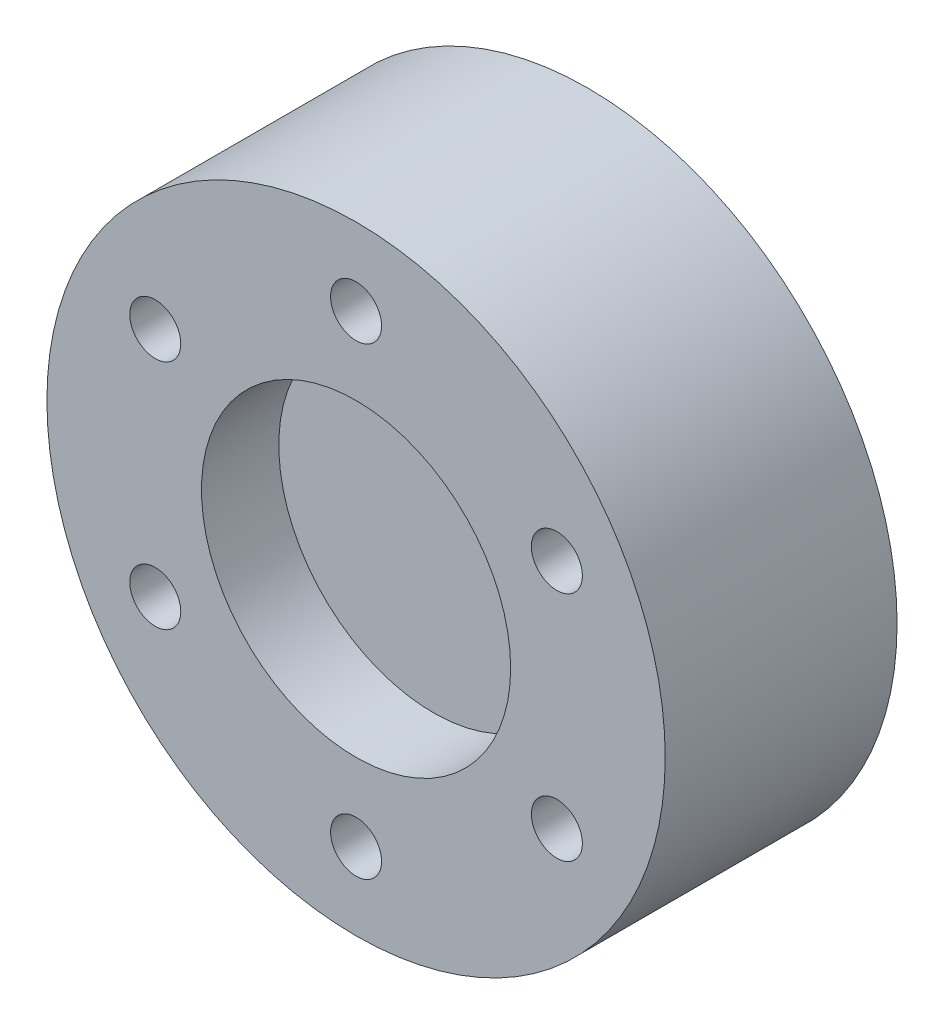
ISO-10303-21;
HEADER;
FILE_DESCRIPTION(('STEP AP214'),'2;1');
FILE_NAME('part.step','',(''),(''),'','','');
FILE_SCHEMA(('AUTOMOTIVE_DESIGN { 1 0 10303 214 1 1 1 1 }'));
ENDSEC;
DATA;
#1=APPLICATION_CONTEXT('core data for automotive mechanical design processes');
#2=APPLICATION_PROTOCOL_DEFINITION('international standard','automotive_design',2000,#1);
#3=PRODUCT_CONTEXT('',#1,'mechanical');
#4=PRODUCT('Part','Part','',(#3));
#5=PRODUCT_RELATED_PRODUCT_CATEGORY('part','',(#4));
#6=PRODUCT_DEFINITION_FORMATION('','',#4);
#7=PRODUCT_DEFINITION_CONTEXT('part definition',#1,'design');
#8=PRODUCT_DEFINITION('design','',#6,#7);
#9=PRODUCT_DEFINITION_SHAPE('','',#8);
#10=(LENGTH_UNIT() NAMED_UNIT(*) SI_UNIT(.MILLI.,.METRE.));
#11=(NAMED_UNIT(*) PLANE_ANGLE_UNIT() SI_UNIT($,.RADIAN.));
#12=(NAMED_UNIT(*) SI_UNIT($,.STERADIAN.) SOLID_ANGLE_UNIT());
#13=UNCERTAINTY_MEASURE_WITH_UNIT(LENGTH_MEASURE(1.E-05),#10,'distance_accuracy_value','');
#14=(GEOMETRIC_REPRESENTATION_CONTEXT(3) GLOBAL_UNCERTAINTY_ASSIGNED_CONTEXT((#13)) GLOBAL_UNIT_ASSIGNED_CONTEXT((#10,
#11,#12)) REPRESENTATION_CONTEXT('',''));
#15=CARTESIAN_POINT('',(0.,0.,0.));
#16=DIRECTION('',(0.,0.,1.));
#17=DIRECTION('',(1.,0.,0.));
#18=AXIS2_PLACEMENT_3D('',#15,#16,#17);
#19=CARTESIAN_POINT('',(0.,0.,15.));
#20=DIRECTION('',(0.,0.,-1.));
#21=DIRECTION('',(-1.,0.,0.));
#22=AXIS2_PLACEMENT_3D('',#19,#20,#21);
#23=CYLINDRICAL_SURFACE('',#22,20.);
#24=CARTESIAN_POINT('',(0.,0.,15.));
#25=DIRECTION('',(0.,0.,1.));
#26=DIRECTION('',(1.,0.,0.));
#27=AXIS2_PLACEMENT_3D('',#24,#25,#26);
#28=CIRCLE('',#27,20.);
#29=CARTESIAN_POINT('',(20.,0.,15.));
#30=VERTEX_POINT('',#29);
#31=EDGE_CURVE('E11',#30,#30,#28,.T.);
#32=ORIENTED_EDGE('',*,*,#31,.F.);
#33=EDGE_LOOP('',(#32));
#34=FACE_BOUND('',#33,.T.);
#35=CARTESIAN_POINT('',(0.,0.,0.));
#36=DIRECTION('',(0.,0.,1.));
#37=DIRECTION('',(1.,0.,0.));
#38=AXIS2_PLACEMENT_3D('',#35,#36,#37);
#39=CIRCLE('',#38,20.);
#40=CARTESIAN_POINT('',(20.,0.,0.));
#41=VERTEX_POINT('',#40);
#42=EDGE_CURVE('E45',#41,#41,#39,.T.);
#43=ORIENTED_EDGE('',*,*,#42,.T.);
#44=EDGE_LOOP('',(#43));
#45=FACE_BOUND('',#44,.T.);
#46=ADVANCED_FACE('F42',(#34,#45),#23,.T.);
#47=CARTESIAN_POINT('',(0.,0.,15.));
#48=DIRECTION('',(0.,0.,1.));
#49=DIRECTION('',(1.,0.,0.));
#50=AXIS2_PLACEMENT_3D('',#47,#48,#49);
#51=PLANE('',#50);
#52=CARTESIAN_POINT('',(12.9903810567665,7.50000000000015,15.));
#53=DIRECTION('',(0.,0.,1.));
#54=DIRECTION('',(1.,0.,0.));
#55=AXIS2_PLACEMENT_3D('',#52,#53,#54);
#56=CIRCLE('',#55,1.65);
#57=CARTESIAN_POINT('',(14.6403810567665,7.50000000000015,15.));
#58=VERTEX_POINT('',#57);
#59=EDGE_CURVE('E79',#58,#58,#56,.T.);
#60=ORIENTED_EDGE('',*,*,#59,.F.);
#61=EDGE_LOOP('',(#60));
#62=FACE_BOUND('',#61,.T.);
#63=CARTESIAN_POINT('',(12.9903810567666,-7.49999999999988,15.));
#64=DIRECTION('',(0.,0.,1.));
#65=DIRECTION('',(1.,0.,0.));
#66=AXIS2_PLACEMENT_3D('',#63,#64,#65);
#67=CIRCLE('',#66,1.65);
#68=CARTESIAN_POINT('',(14.6403810567666,-7.49999999999988,15.));
#69=VERTEX_POINT('',#68);
#70=EDGE_CURVE('E78',#69,#69,#67,.T.);
#71=ORIENTED_EDGE('',*,*,#70,.F.);
#72=EDGE_LOOP('',(#71));
#73=FACE_BOUND('',#72,.T.);
#74=CARTESIAN_POINT('',(0.,-15.,15.));
#75=DIRECTION('',(0.,0.,1.));
#76=DIRECTION('',(1.,0.,0.));
#77=AXIS2_PLACEMENT_3D('',#74,#75,#76);
#78=CIRCLE('',#77,1.65);
#79=CARTESIAN_POINT('',(1.65,-15.,15.));
#80=VERTEX_POINT('',#79);
#81=EDGE_CURVE('E91',#80,#80,#78,.T.);
#82=ORIENTED_EDGE('',*,*,#81,.F.);
#83=EDGE_LOOP('',(#82));
#84=FACE_BOUND('',#83,.T.);
#85=CARTESIAN_POINT('',(-12.9903810567665,-7.50000000000006,15.));
#86=DIRECTION('',(0.,0.,1.));
#87=DIRECTION('',(1.,0.,0.));
#88=AXIS2_PLACEMENT_3D('',#85,#86,#87);
#89=CIRCLE('',#88,1.65);
#90=CARTESIAN_POINT('',(-11.3403810567665,-7.50000000000006,15.));
#91=VERTEX_POINT('',#90);
#92=EDGE_CURVE('E97',#91,#91,#89,.T.);
#93=ORIENTED_EDGE('',*,*,#92,.F.);
#94=EDGE_LOOP('',(#93));
#95=FACE_BOUND('',#94,.T.);
#96=CARTESIAN_POINT('',(-12.9903810567666,7.49999999999997,15.));
#97=DIRECTION('',(0.,0.,1.));
#98=DIRECTION('',(1.,0.,0.));
#99=AXIS2_PLACEMENT_3D('',#96,#97,#98);
#100=CIRCLE('',#99,1.65);
#101=CARTESIAN_POINT('',(-11.3403810567666,7.49999999999997,15.));
#102=VERTEX_POINT('',#101);
#103=EDGE_CURVE('E103',#102,#102,#100,.T.);
#104=ORIENTED_EDGE('',*,*,#103,.F.);
#105=EDGE_LOOP('',(#104));
#106=FACE_BOUND('',#105,.T.);
#107=CARTESIAN_POINT('',(0.,15.,15.));
#108=DIRECTION('',(0.,0.,1.));
#109=DIRECTION('',(1.,0.,0.));
#110=AXIS2_PLACEMENT_3D('',#107,#108,#109);
#111=CIRCLE('',#110,1.65);
#112=CARTESIAN_POINT('',(1.65,15.,15.));
#113=VERTEX_POINT('',#112);
#114=EDGE_CURVE('E109',#113,#113,#111,.T.);
#115=ORIENTED_EDGE('',*,*,#114,.F.);
#116=EDGE_LOOP('',(#115));
#117=FACE_BOUND('',#116,.T.);
#118=CARTESIAN_POINT('',(0.,0.,15.));
#119=DIRECTION('',(0.,0.,1.));
#120=DIRECTION('',(1.,0.,0.));
#121=AXIS2_PLACEMENT_3D('',#118,#119,#120);
#122=CIRCLE('',#121,10.);
#123=CARTESIAN_POINT('',(10.,0.,15.));
#124=VERTEX_POINT('',#123);
#125=EDGE_CURVE('E115',#124,#124,#122,.T.);
#126=ORIENTED_EDGE('',*,*,#125,.F.);
#127=EDGE_LOOP('',(#126));
#128=FACE_BOUND('',#127,.T.);
#129=ORIENTED_EDGE('',*,*,#31,.T.);
#130=EDGE_LOOP('',(#129));
#131=FACE_BOUND('',#130,.T.);
#132=ADVANCED_FACE('F124',(#62,#73,#84,#95,#106,#117,#128,#131),#51,.T.);
#133=CARTESIAN_POINT('',(0.,0.,0.));
#134=DIRECTION('',(0.,0.,1.));
#135=DIRECTION('',(1.,0.,0.));
#136=AXIS2_PLACEMENT_3D('',#133,#134,#135);
#137=PLANE('',#136);
#138=CARTESIAN_POINT('',(0.,0.,0.));
#139=DIRECTION('',(0.,0.,-1.));
#140=DIRECTION('',(-1.,0.,0.));
#141=AXIS2_PLACEMENT_3D('',#138,#139,#140);
#142=CIRCLE('',#141,17.5);
#143=CARTESIAN_POINT('',(-17.5,0.,0.));
#144=VERTEX_POINT('',#143);
#145=EDGE_CURVE('E200',#144,#144,#142,.T.);
#146=ORIENTED_EDGE('',*,*,#145,.F.);
#147=EDGE_LOOP('',(#146));
#148=FACE_BOUND('',#147,.T.);
#149=ORIENTED_EDGE('',*,*,#42,.F.);
#150=EDGE_LOOP('',(#149));
#151=FACE_BOUND('',#150,.T.);
#152=ADVANCED_FACE('F127',(#148,#151),#137,.F.);
#153=CARTESIAN_POINT('',(0.,0.,10.));
#154=DIRECTION('',(0.,0.,1.));
#155=DIRECTION('',(1.,0.,0.));
#156=AXIS2_PLACEMENT_3D('',#153,#154,#155);
#157=CYLINDRICAL_SURFACE('',#156,10.);
#158=CARTESIAN_POINT('',(0.,0.,10.));
#159=DIRECTION('',(0.,0.,1.));
#160=DIRECTION('',(1.,0.,0.));
#161=AXIS2_PLACEMENT_3D('',#158,#159,#160);
#162=CIRCLE('',#161,10.);
#163=CARTESIAN_POINT('',(10.,0.,10.));
#164=VERTEX_POINT('',#163);
#165=EDGE_CURVE('E116',#164,#164,#162,.T.);
#166=ORIENTED_EDGE('',*,*,#165,.F.);
#167=EDGE_LOOP('',(#166));
#168=FACE_BOUND('',#167,.T.);
#169=ORIENTED_EDGE('',*,*,#125,.T.);
#170=EDGE_LOOP('',(#169));
#171=FACE_BOUND('',#170,.T.);
#172=ADVANCED_FACE('F122',(#168,#171),#157,.F.);
#173=CARTESIAN_POINT('',(0.,0.,10.));
#174=DIRECTION('',(0.,0.,1.));
#175=DIRECTION('',(1.,0.,0.));
#176=AXIS2_PLACEMENT_3D('',#173,#174,#175);
#177=PLANE('',#176);
#178=ORIENTED_EDGE('',*,*,#165,.T.);
#179=EDGE_LOOP('',(#178));
#180=FACE_BOUND('',#179,.T.);
#181=ADVANCED_FACE('F142',(#180),#177,.T.);
#182=CARTESIAN_POINT('',(0.,15.,4.9));
#183=DIRECTION('',(0.,0.,1.));
#184=DIRECTION('',(1.,0.,0.));
#185=AXIS2_PLACEMENT_3D('',#182,#183,#184);
#186=CONICAL_SURFACE('',#185,1.65,1.02974425867665);
#187=CARTESIAN_POINT('',(0.,15.,3.90857997860452));
#188=VERTEX_POINT('',#187);
#189=VERTEX_LOOP('',#188);
#190=FACE_BOUND('',#189,.T.);
#191=CARTESIAN_POINT('',(0.,15.,4.9));
#192=DIRECTION('',(0.,0.,1.));
#193=DIRECTION('',(1.,0.,0.));
#194=AXIS2_PLACEMENT_3D('',#191,#192,#193);
#195=CIRCLE('',#194,1.65);
#196=CARTESIAN_POINT('',(1.65,15.,4.9));
#197=VERTEX_POINT('',#196);
#198=EDGE_CURVE('E112',#197,#197,#195,.T.);
#199=ORIENTED_EDGE('',*,*,#198,.T.);
#200=EDGE_LOOP('',(#199));
#201=FACE_BOUND('',#200,.T.);
#202=ADVANCED_FACE('F149',(#190,#201),#186,.F.);
#203=CARTESIAN_POINT('',(0.,15.,15.));
#204=DIRECTION('',(0.,0.,1.));
#205=DIRECTION('',(1.,0.,0.));
#206=AXIS2_PLACEMENT_3D('',#203,#204,#205);
#207=CYLINDRICAL_SURFACE('',#206,1.65);
#208=ORIENTED_EDGE('',*,*,#198,.F.);
#209=EDGE_LOOP('',(#208));
#210=FACE_BOUND('',#209,.T.);
#211=ORIENTED_EDGE('',*,*,#114,.T.);
#212=EDGE_LOOP('',(#211));
#213=FACE_BOUND('',#212,.T.);
#214=ADVANCED_FACE('F153',(#210,#213),#207,.F.);
#215=CARTESIAN_POINT('',(-12.9903810567666,7.49999999999997,4.9));
#216=DIRECTION('',(0.,0.,1.));
#217=DIRECTION('',(1.,0.,0.));
#218=AXIS2_PLACEMENT_3D('',#215,#216,#217);
#219=CONICAL_SURFACE('',#218,1.65,1.02974425867665);
#220=CARTESIAN_POINT('',(-12.9903810567666,7.49999999999997,3.90857997860452));
#221=VERTEX_POINT('',#220);
#222=VERTEX_LOOP('',#221);
#223=FACE_BOUND('',#222,.T.);
#224=CARTESIAN_POINT('',(-12.9903810567666,7.49999999999997,4.9));
#225=DIRECTION('',(0.,0.,1.));
#226=DIRECTION('',(1.,0.,0.));
#227=AXIS2_PLACEMENT_3D('',#224,#225,#226);
#228=CIRCLE('',#227,1.65);
#229=CARTESIAN_POINT('',(-11.3403810567666,7.49999999999997,4.9));
#230=VERTEX_POINT('',#229);
#231=EDGE_CURVE('E106',#230,#230,#228,.T.);
#232=ORIENTED_EDGE('',*,*,#231,.T.);
#233=EDGE_LOOP('',(#232));
#234=FACE_BOUND('',#233,.T.);
#235=ADVANCED_FACE('F156',(#223,#234),#219,.F.);
#236=CARTESIAN_POINT('',(-12.9903810567666,7.49999999999997,15.));
#237=DIRECTION('',(0.,0.,1.));
#238=DIRECTION('',(1.,0.,0.));
#239=AXIS2_PLACEMENT_3D('',#236,#237,#238);
#240=CYLINDRICAL_SURFACE('',#239,1.65);
#241=ORIENTED_EDGE('',*,*,#231,.F.);
#242=EDGE_LOOP('',(#241));
#243=FACE_BOUND('',#242,.T.);
#244=ORIENTED_EDGE('',*,*,#103,.T.);
#245=EDGE_LOOP('',(#244));
#246=FACE_BOUND('',#245,.T.);
#247=ADVANCED_FACE('F160',(#243,#246),#240,.F.);
#248=CARTESIAN_POINT('',(-12.9903810567665,-7.50000000000006,4.9));
#249=DIRECTION('',(0.,0.,1.));
#250=DIRECTION('',(1.,0.,0.));
#251=AXIS2_PLACEMENT_3D('',#248,#249,#250);
#252=CONICAL_SURFACE('',#251,1.65,1.02974425867665);
#253=CARTESIAN_POINT('',(-12.9903810567665,-7.50000000000006,3.90857997860452));
#254=VERTEX_POINT('',#253);
#255=VERTEX_LOOP('',#254);
#256=FACE_BOUND('',#255,.T.);
#257=CARTESIAN_POINT('',(-12.9903810567665,-7.50000000000006,4.9));
#258=DIRECTION('',(0.,0.,1.));
#259=DIRECTION('',(1.,0.,0.));
#260=AXIS2_PLACEMENT_3D('',#257,#258,#259);
#261=CIRCLE('',#260,1.65);
#262=CARTESIAN_POINT('',(-11.3403810567665,-7.50000000000006,4.9));
#263=VERTEX_POINT('',#262);
#264=EDGE_CURVE('E100',#263,#263,#261,.T.);
#265=ORIENTED_EDGE('',*,*,#264,.T.);
#266=EDGE_LOOP('',(#265));
#267=FACE_BOUND('',#266,.T.);
#268=ADVANCED_FACE('F163',(#256,#267),#252,.F.);
#269=CARTESIAN_POINT('',(-12.9903810567665,-7.50000000000006,15.));
#270=DIRECTION('',(0.,0.,1.));
#271=DIRECTION('',(1.,0.,0.));
#272=AXIS2_PLACEMENT_3D('',#269,#270,#271);
#273=CYLINDRICAL_SURFACE('',#272,1.65);
#274=ORIENTED_EDGE('',*,*,#264,.F.);
#275=EDGE_LOOP('',(#274));
#276=FACE_BOUND('',#275,.T.);
#277=ORIENTED_EDGE('',*,*,#92,.T.);
#278=EDGE_LOOP('',(#277));
#279=FACE_BOUND('',#278,.T.);
#280=ADVANCED_FACE('F167',(#276,#279),#273,.F.);
#281=CARTESIAN_POINT('',(0.,-15.,4.9));
#282=DIRECTION('',(0.,0.,1.));
#283=DIRECTION('',(1.,0.,0.));
#284=AXIS2_PLACEMENT_3D('',#281,#282,#283);
#285=CONICAL_SURFACE('',#284,1.65,1.02974425867665);
#286=CARTESIAN_POINT('',(0.,-15.,3.90857997860452));
#287=VERTEX_POINT('',#286);
#288=VERTEX_LOOP('',#287);
#289=FACE_BOUND('',#288,.T.);
#290=CARTESIAN_POINT('',(0.,-15.,4.9));
#291=DIRECTION('',(0.,0.,1.));
#292=DIRECTION('',(1.,0.,0.));
#293=AXIS2_PLACEMENT_3D('',#290,#291,#292);
#294=CIRCLE('',#293,1.65);
#295=CARTESIAN_POINT('',(1.65,-15.,4.9));
#296=VERTEX_POINT('',#295);
#297=EDGE_CURVE('E94',#296,#296,#294,.T.);
#298=ORIENTED_EDGE('',*,*,#297,.T.);
#299=EDGE_LOOP('',(#298));
#300=FACE_BOUND('',#299,.T.);
#301=ADVANCED_FACE('F171',(#289,#300),#285,.F.);
#302=CARTESIAN_POINT('',(0.,-15.,15.));
#303=DIRECTION('',(0.,0.,1.));
#304=DIRECTION('',(1.,0.,0.));
#305=AXIS2_PLACEMENT_3D('',#302,#303,#304);
#306=CYLINDRICAL_SURFACE('',#305,1.65);
#307=ORIENTED_EDGE('',*,*,#297,.F.);
#308=EDGE_LOOP('',(#307));
#309=FACE_BOUND('',#308,.T.);
#310=ORIENTED_EDGE('',*,*,#81,.T.);
#311=EDGE_LOOP('',(#310));
#312=FACE_BOUND('',#311,.T.);
#313=ADVANCED_FACE('F175',(#309,#312),#306,.F.);
#314=CARTESIAN_POINT('',(12.9903810567666,-7.49999999999988,4.9));
#315=DIRECTION('',(0.,0.,1.));
#316=DIRECTION('',(1.,0.,0.));
#317=AXIS2_PLACEMENT_3D('',#314,#315,#316);
#318=CONICAL_SURFACE('',#317,1.65,1.02974425867665);
#319=CARTESIAN_POINT('',(12.9903810567666,-7.49999999999988,3.90857997860452));
#320=VERTEX_POINT('',#319);
#321=VERTEX_LOOP('',#320);
#322=FACE_BOUND('',#321,.T.);
#323=CARTESIAN_POINT('',(12.9903810567666,-7.49999999999988,4.9));
#324=DIRECTION('',(0.,0.,1.));
#325=DIRECTION('',(1.,0.,0.));
#326=AXIS2_PLACEMENT_3D('',#323,#324,#325);
#327=CIRCLE('',#326,1.65);
#328=CARTESIAN_POINT('',(14.6403810567666,-7.49999999999988,4.9));
#329=VERTEX_POINT('',#328);
#330=EDGE_CURVE('E82',#329,#329,#327,.T.);
#331=ORIENTED_EDGE('',*,*,#330,.T.);
#332=EDGE_LOOP('',(#331));
#333=FACE_BOUND('',#332,.T.);
#334=ADVANCED_FACE('F179',(#322,#333),#318,.F.);
#335=CARTESIAN_POINT('',(12.9903810567666,-7.49999999999988,15.));
#336=DIRECTION('',(0.,0.,1.));
#337=DIRECTION('',(1.,0.,0.));
#338=AXIS2_PLACEMENT_3D('',#335,#336,#337);
#339=CYLINDRICAL_SURFACE('',#338,1.65);
#340=ORIENTED_EDGE('',*,*,#330,.F.);
#341=EDGE_LOOP('',(#340));
#342=FACE_BOUND('',#341,.T.);
#343=ORIENTED_EDGE('',*,*,#70,.T.);
#344=EDGE_LOOP('',(#343));
#345=FACE_BOUND('',#344,.T.);
#346=ADVANCED_FACE('F72',(#342,#345),#339,.F.);
#347=CARTESIAN_POINT('',(12.9903810567665,7.50000000000015,4.9));
#348=DIRECTION('',(0.,0.,1.));
#349=DIRECTION('',(1.,0.,0.));
#350=AXIS2_PLACEMENT_3D('',#347,#348,#349);
#351=CONICAL_SURFACE('',#350,1.65,1.02974425867665);
#352=CARTESIAN_POINT('',(12.9903810567665,7.50000000000015,3.90857997860452));
#353=VERTEX_POINT('',#352);
#354=VERTEX_LOOP('',#353);
#355=FACE_BOUND('',#354,.T.);
#356=CARTESIAN_POINT('',(12.9903810567665,7.50000000000015,4.9));
#357=DIRECTION('',(0.,0.,1.));
#358=DIRECTION('',(1.,0.,0.));
#359=AXIS2_PLACEMENT_3D('',#356,#357,#358);
#360=CIRCLE('',#359,1.65);
#361=CARTESIAN_POINT('',(14.6403810567665,7.50000000000015,4.9));
#362=VERTEX_POINT('',#361);
#363=EDGE_CURVE('E76',#362,#362,#360,.T.);
#364=ORIENTED_EDGE('',*,*,#363,.T.);
#365=EDGE_LOOP('',(#364));
#366=FACE_BOUND('',#365,.T.);
#367=ADVANCED_FACE('F68',(#355,#366),#351,.F.);
#368=CARTESIAN_POINT('',(12.9903810567665,7.50000000000015,15.));
#369=DIRECTION('',(0.,0.,1.));
#370=DIRECTION('',(1.,0.,0.));
#371=AXIS2_PLACEMENT_3D('',#368,#369,#370);
#372=CYLINDRICAL_SURFACE('',#371,1.65);
#373=ORIENTED_EDGE('',*,*,#363,.F.);
#374=EDGE_LOOP('',(#373));
#375=FACE_BOUND('',#374,.T.);
#376=ORIENTED_EDGE('',*,*,#59,.T.);
#377=EDGE_LOOP('',(#376));
#378=FACE_BOUND('',#377,.T.);
#379=ADVANCED_FACE('F71',(#375,#378),#372,.F.);
#380=CARTESIAN_POINT('',(0.,0.,3.));
#381=DIRECTION('',(0.,0.,-1.));
#382=DIRECTION('',(-1.,0.,0.));
#383=AXIS2_PLACEMENT_3D('',#380,#381,#382);
#384=CYLINDRICAL_SURFACE('',#383,17.5);
#385=CARTESIAN_POINT('',(0.,0.,3.));
#386=DIRECTION('',(0.,0.,-1.));
#387=DIRECTION('',(-1.,0.,0.));
#388=AXIS2_PLACEMENT_3D('',#385,#386,#387);
#389=CIRCLE('',#388,17.5);
#390=CARTESIAN_POINT('',(-17.5,0.,3.));
#391=VERTEX_POINT('',#390);
#392=EDGE_CURVE('E85',#391,#391,#389,.T.);
#393=ORIENTED_EDGE('',*,*,#392,.F.);
#394=EDGE_LOOP('',(#393));
#395=FACE_BOUND('',#394,.T.);
#396=ORIENTED_EDGE('',*,*,#145,.T.);
#397=EDGE_LOOP('',(#396));
#398=FACE_BOUND('',#397,.T.);
#399=ADVANCED_FACE('F189',(#395,#398),#384,.F.);
#400=CARTESIAN_POINT('',(0.,0.,3.));
#401=DIRECTION('',(0.,0.,-1.));
#402=DIRECTION('',(-1.,0.,0.));
#403=AXIS2_PLACEMENT_3D('',#400,#401,#402);
#404=PLANE('',#403);
#405=ORIENTED_EDGE('',*,*,#392,.T.);
#406=EDGE_LOOP('',(#405));
#407=FACE_BOUND('',#406,.T.);
#408=ADVANCED_FACE('F192',(#407),#404,.T.);
#409=CLOSED_SHELL('',(#46,#132,#152,#172,#181,#202,#214,#235,#247,#268,#280,#301,#313,#334,#346,
#367,#379,#399,#408));
#410=MANIFOLD_SOLID_BREP('B2',#409);
#411=ADVANCED_BREP_SHAPE_REPRESENTATION('',(#18,#410),#14);
#412=SHAPE_DEFINITION_REPRESENTATION(#9,#411);
ENDSEC;
END-ISO-10303-21;
